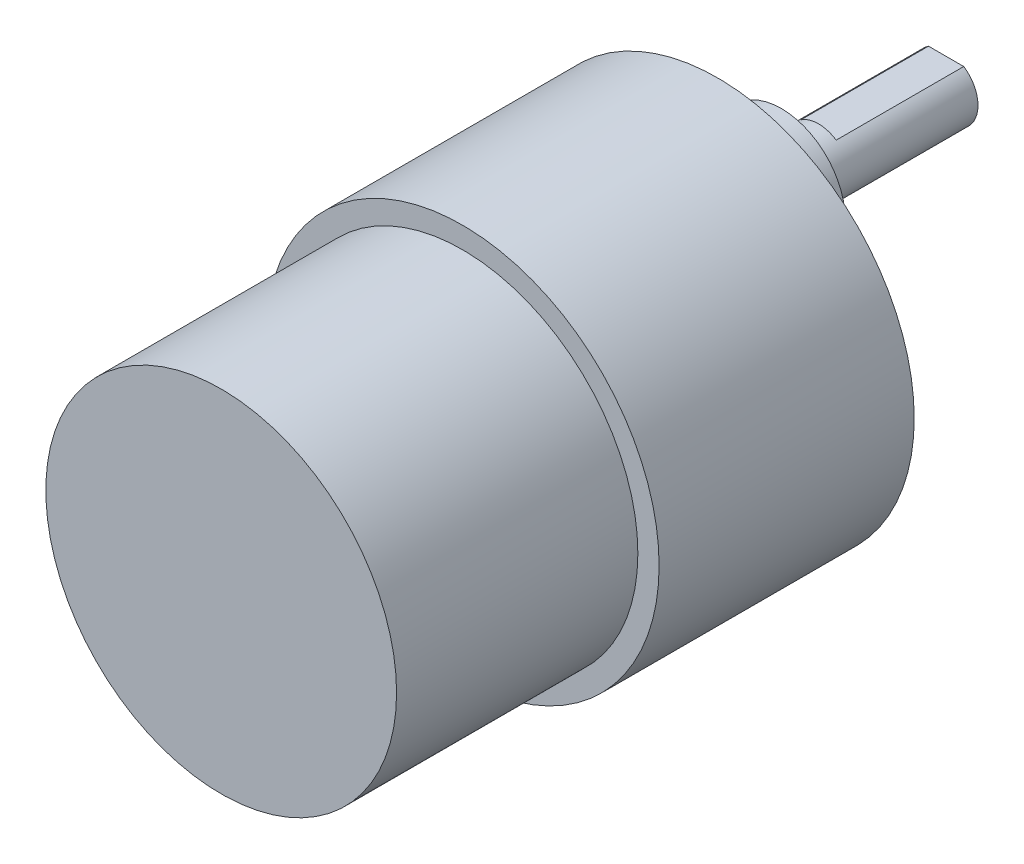
ISO-10303-21;
HEADER;
FILE_DESCRIPTION(('STEP AP214'),'2;1');
FILE_NAME('part.step','',(''),(''),'','','');
FILE_SCHEMA(('AUTOMOTIVE_DESIGN { 1 0 10303 214 1 1 1 1 }'));
ENDSEC;
DATA;
#1=APPLICATION_CONTEXT('core data for automotive mechanical design processes');
#2=APPLICATION_PROTOCOL_DEFINITION('international standard','automotive_design',2000,#1);
#3=PRODUCT_CONTEXT('',#1,'mechanical');
#4=PRODUCT('Part','Part','',(#3));
#5=PRODUCT_RELATED_PRODUCT_CATEGORY('part','',(#4));
#6=PRODUCT_DEFINITION_FORMATION('','',#4);
#7=PRODUCT_DEFINITION_CONTEXT('part definition',#1,'design');
#8=PRODUCT_DEFINITION('design','',#6,#7);
#9=PRODUCT_DEFINITION_SHAPE('','',#8);
#10=(LENGTH_UNIT() NAMED_UNIT(*) SI_UNIT(.MILLI.,.METRE.));
#11=(NAMED_UNIT(*) PLANE_ANGLE_UNIT() SI_UNIT($,.RADIAN.));
#12=(NAMED_UNIT(*) SI_UNIT($,.STERADIAN.) SOLID_ANGLE_UNIT());
#13=UNCERTAINTY_MEASURE_WITH_UNIT(LENGTH_MEASURE(1.E-05),#10,'distance_accuracy_value','');
#14=(GEOMETRIC_REPRESENTATION_CONTEXT(3) GLOBAL_UNCERTAINTY_ASSIGNED_CONTEXT((#13)) GLOBAL_UNIT_ASSIGNED_CONTEXT((#10,
#11,#12)) REPRESENTATION_CONTEXT('',''));
#15=CARTESIAN_POINT('',(0.,0.,0.));
#16=DIRECTION('',(0.,0.,1.));
#17=DIRECTION('',(1.,0.,0.));
#18=AXIS2_PLACEMENT_3D('',#15,#16,#17);
#19=CARTESIAN_POINT('',(0.,0.,24.));
#20=DIRECTION('',(0.,0.,-1.));
#21=DIRECTION('',(-1.,0.,0.));
#22=AXIS2_PLACEMENT_3D('',#19,#20,#21);
#23=CYLINDRICAL_SURFACE('',#22,18.5);
#24=CARTESIAN_POINT('',(0.,0.,24.));
#25=DIRECTION('',(0.,0.,1.));
#26=DIRECTION('',(1.,0.,0.));
#27=AXIS2_PLACEMENT_3D('',#24,#25,#26);
#28=CIRCLE('',#27,18.5);
#29=CARTESIAN_POINT('',(18.5,0.,24.));
#30=VERTEX_POINT('',#29);
#31=EDGE_CURVE('E147',#30,#30,#28,.T.);
#32=ORIENTED_EDGE('',*,*,#31,.F.);
#33=EDGE_LOOP('',(#32));
#34=FACE_BOUND('',#33,.T.);
#35=CARTESIAN_POINT('',(0.,0.,0.));
#36=DIRECTION('',(0.,0.,1.));
#37=DIRECTION('',(1.,0.,0.));
#38=AXIS2_PLACEMENT_3D('',#35,#36,#37);
#39=CIRCLE('',#38,18.5);
#40=CARTESIAN_POINT('',(18.5,0.,0.));
#41=VERTEX_POINT('',#40);
#42=EDGE_CURVE('E144',#41,#41,#39,.T.);
#43=ORIENTED_EDGE('',*,*,#42,.T.);
#44=EDGE_LOOP('',(#43));
#45=FACE_BOUND('',#44,.T.);
#46=ADVANCED_FACE('F39',(#34,#45),#23,.T.);
#47=CARTESIAN_POINT('',(0.,0.,24.));
#48=DIRECTION('',(0.,0.,1.));
#49=DIRECTION('',(1.,0.,0.));
#50=AXIS2_PLACEMENT_3D('',#47,#48,#49);
#51=PLANE('',#50);
#52=CARTESIAN_POINT('',(0.,0.,24.));
#53=DIRECTION('',(0.,0.,1.));
#54=DIRECTION('',(1.,0.,0.));
#55=AXIS2_PLACEMENT_3D('',#52,#53,#54);
#56=CIRCLE('',#55,16.5);
#57=CARTESIAN_POINT('',(16.5,0.,24.));
#58=VERTEX_POINT('',#57);
#59=EDGE_CURVE('E140',#58,#58,#56,.T.);
#60=ORIENTED_EDGE('',*,*,#59,.F.);
#61=EDGE_LOOP('',(#60));
#62=FACE_BOUND('',#61,.T.);
#63=ORIENTED_EDGE('',*,*,#31,.T.);
#64=EDGE_LOOP('',(#63));
#65=FACE_BOUND('',#64,.T.);
#66=ADVANCED_FACE('F175',(#62,#65),#51,.T.);
#67=CARTESIAN_POINT('',(0.,0.,0.));
#68=DIRECTION('',(0.,0.,1.));
#69=DIRECTION('',(1.,0.,0.));
#70=AXIS2_PLACEMENT_3D('',#67,#68,#69);
#71=PLANE('',#70);
#72=CARTESIAN_POINT('',(15.5,0.,0.));
#73=DIRECTION('',(0.,0.,-1.));
#74=DIRECTION('',(-1.,0.,0.));
#75=AXIS2_PLACEMENT_3D('',#72,#73,#74);
#76=CIRCLE('',#75,1.25);
#77=CARTESIAN_POINT('',(14.25,0.,0.));
#78=VERTEX_POINT('',#77);
#79=EDGE_CURVE('E93',#78,#78,#76,.T.);
#80=ORIENTED_EDGE('',*,*,#79,.F.);
#81=EDGE_LOOP('',(#80));
#82=FACE_BOUND('',#81,.T.);
#83=CARTESIAN_POINT('',(7.74999999999997,13.4233937586588,0.));
#84=DIRECTION('',(0.,0.,-1.));
#85=DIRECTION('',(-1.,0.,0.));
#86=AXIS2_PLACEMENT_3D('',#83,#84,#85);
#87=CIRCLE('',#86,1.25);
#88=CARTESIAN_POINT('',(6.49999999999997,13.4233937586588,0.));
#89=VERTEX_POINT('',#88);
#90=EDGE_CURVE('E92',#89,#89,#87,.T.);
#91=ORIENTED_EDGE('',*,*,#90,.F.);
#92=EDGE_LOOP('',(#91));
#93=FACE_BOUND('',#92,.T.);
#94=CARTESIAN_POINT('',(-7.75000000000006,13.4233937586588,0.));
#95=DIRECTION('',(0.,0.,-1.));
#96=DIRECTION('',(-1.,0.,0.));
#97=AXIS2_PLACEMENT_3D('',#94,#95,#96);
#98=CIRCLE('',#97,1.25);
#99=CARTESIAN_POINT('',(-9.00000000000006,13.4233937586588,0.));
#100=VERTEX_POINT('',#99);
#101=EDGE_CURVE('E103',#100,#100,#98,.T.);
#102=ORIENTED_EDGE('',*,*,#101,.F.);
#103=EDGE_LOOP('',(#102));
#104=FACE_BOUND('',#103,.T.);
#105=CARTESIAN_POINT('',(-15.5,-1.04766474552184E-13,0.));
#106=DIRECTION('',(0.,0.,-1.));
#107=DIRECTION('',(-1.,0.,0.));
#108=AXIS2_PLACEMENT_3D('',#105,#106,#107);
#109=CIRCLE('',#108,1.25);
#110=CARTESIAN_POINT('',(-16.75,-1.04766474552184E-13,0.));
#111=VERTEX_POINT('',#110);
#112=EDGE_CURVE('E109',#111,#111,#109,.T.);
#113=ORIENTED_EDGE('',*,*,#112,.F.);
#114=EDGE_LOOP('',(#113));
#115=FACE_BOUND('',#114,.T.);
#116=CARTESIAN_POINT('',(-7.74999999999988,-13.4233937586589,0.));
#117=DIRECTION('',(0.,0.,-1.));
#118=DIRECTION('',(-1.,0.,0.));
#119=AXIS2_PLACEMENT_3D('',#116,#117,#118);
#120=CIRCLE('',#119,1.25);
#121=CARTESIAN_POINT('',(-8.99999999999987,-13.4233937586589,0.));
#122=VERTEX_POINT('',#121);
#123=EDGE_CURVE('E115',#122,#122,#120,.T.);
#124=ORIENTED_EDGE('',*,*,#123,.F.);
#125=EDGE_LOOP('',(#124));
#126=FACE_BOUND('',#125,.T.);
#127=CARTESIAN_POINT('',(7.75000000000016,-13.4233937586587,0.));
#128=DIRECTION('',(0.,0.,-1.));
#129=DIRECTION('',(-1.,0.,0.));
#130=AXIS2_PLACEMENT_3D('',#127,#128,#129);
#131=CIRCLE('',#130,1.25);
#132=CARTESIAN_POINT('',(6.50000000000016,-13.4233937586587,0.));
#133=VERTEX_POINT('',#132);
#134=EDGE_CURVE('E121',#133,#133,#131,.T.);
#135=ORIENTED_EDGE('',*,*,#134,.F.);
#136=EDGE_LOOP('',(#135));
#137=FACE_BOUND('',#136,.T.);
#138=CARTESIAN_POINT('',(0.,7.,0.));
#139=DIRECTION('',(0.,0.,1.));
#140=DIRECTION('',(1.,0.,0.));
#141=AXIS2_PLACEMENT_3D('',#138,#139,#140);
#142=CIRCLE('',#141,6.);
#143=CARTESIAN_POINT('',(6.,7.,0.));
#144=VERTEX_POINT('',#143);
#145=EDGE_CURVE('E150',#144,#144,#142,.F.);
#146=ORIENTED_EDGE('',*,*,#145,.F.);
#147=EDGE_LOOP('',(#146));
#148=FACE_BOUND('',#147,.T.);
#149=ORIENTED_EDGE('',*,*,#42,.F.);
#150=EDGE_LOOP('',(#149));
#151=FACE_BOUND('',#150,.T.);
#152=ADVANCED_FACE('F181',(#82,#93,#104,#115,#126,#137,#148,#151),#71,.F.);
#153=CARTESIAN_POINT('',(0.,0.,46.7));
#154=DIRECTION('',(0.,0.,-1.));
#155=DIRECTION('',(-1.,0.,0.));
#156=AXIS2_PLACEMENT_3D('',#153,#154,#155);
#157=CYLINDRICAL_SURFACE('',#156,16.5);
#158=CARTESIAN_POINT('',(0.,0.,46.7));
#159=DIRECTION('',(0.,0.,1.));
#160=DIRECTION('',(1.,0.,0.));
#161=AXIS2_PLACEMENT_3D('',#158,#159,#160);
#162=CIRCLE('',#161,16.5);
#163=CARTESIAN_POINT('',(16.5,0.,46.7));
#164=VERTEX_POINT('',#163);
#165=EDGE_CURVE('E141',#164,#164,#162,.T.);
#166=ORIENTED_EDGE('',*,*,#165,.F.);
#167=EDGE_LOOP('',(#166));
#168=FACE_BOUND('',#167,.T.);
#169=ORIENTED_EDGE('',*,*,#59,.T.);
#170=EDGE_LOOP('',(#169));
#171=FACE_BOUND('',#170,.T.);
#172=ADVANCED_FACE('F189',(#168,#171),#157,.T.);
#173=CARTESIAN_POINT('',(0.,0.,46.7));
#174=DIRECTION('',(0.,0.,1.));
#175=DIRECTION('',(1.,0.,0.));
#176=AXIS2_PLACEMENT_3D('',#173,#174,#175);
#177=PLANE('',#176);
#178=ORIENTED_EDGE('',*,*,#165,.T.);
#179=EDGE_LOOP('',(#178));
#180=FACE_BOUND('',#179,.T.);
#181=ADVANCED_FACE('F196',(#180),#177,.T.);
#182=CARTESIAN_POINT('',(0.,7.,-6.));
#183=DIRECTION('',(0.,0.,1.));
#184=DIRECTION('',(1.,0.,0.));
#185=AXIS2_PLACEMENT_3D('',#182,#183,#184);
#186=CYLINDRICAL_SURFACE('',#185,6.);
#187=CARTESIAN_POINT('',(0.,7.,-6.));
#188=DIRECTION('',(0.,0.,-1.));
#189=DIRECTION('',(-1.,0.,0.));
#190=AXIS2_PLACEMENT_3D('',#187,#188,#189);
#191=CIRCLE('',#190,6.);
#192=CARTESIAN_POINT('',(-6.,7.,-6.));
#193=VERTEX_POINT('',#192);
#194=EDGE_CURVE('E135',#193,#193,#191,.T.);
#195=ORIENTED_EDGE('',*,*,#194,.F.);
#196=EDGE_LOOP('',(#195));
#197=FACE_BOUND('',#196,.T.);
#198=ORIENTED_EDGE('',*,*,#145,.T.);
#199=EDGE_LOOP('',(#198));
#200=FACE_BOUND('',#199,.T.);
#201=ADVANCED_FACE('F204',(#197,#200),#186,.T.);
#202=CARTESIAN_POINT('',(0.,7.,-6.));
#203=DIRECTION('',(0.,0.,-1.));
#204=DIRECTION('',(-1.,0.,0.));
#205=AXIS2_PLACEMENT_3D('',#202,#203,#204);
#206=PLANE('',#205);
#207=CARTESIAN_POINT('',(0.,7.,-6.));
#208=DIRECTION('',(0.,0.,-1.));
#209=DIRECTION('',(-1.,0.,0.));
#210=AXIS2_PLACEMENT_3D('',#207,#208,#209);
#211=CIRCLE('',#210,3.);
#212=CARTESIAN_POINT('',(-3.,7.,-6.));
#213=VERTEX_POINT('',#212);
#214=EDGE_CURVE('E131',#213,#213,#211,.T.);
#215=ORIENTED_EDGE('',*,*,#214,.F.);
#216=EDGE_LOOP('',(#215));
#217=FACE_BOUND('',#216,.T.);
#218=ORIENTED_EDGE('',*,*,#194,.T.);
#219=EDGE_LOOP('',(#218));
#220=FACE_BOUND('',#219,.T.);
#221=ADVANCED_FACE('F171',(#217,#220),#206,.T.);
#222=CARTESIAN_POINT('',(0.,7.,-21.5));
#223=DIRECTION('',(0.,0.,1.));
#224=DIRECTION('',(1.,0.,0.));
#225=AXIS2_PLACEMENT_3D('',#222,#223,#224);
#226=CYLINDRICAL_SURFACE('',#225,3.);
#227=CARTESIAN_POINT('',(0.,7.,-21.5));
#228=DIRECTION('',(0.,0.,-1.));
#229=DIRECTION('',(-1.,0.,0.));
#230=AXIS2_PLACEMENT_3D('',#227,#228,#229);
#231=CIRCLE('',#230,3.);
#232=CARTESIAN_POINT('',(1.6583123951777,9.5,-21.5));
#233=VERTEX_POINT('',#232);
#234=CARTESIAN_POINT('',(-1.6583123951777,9.5,-21.5));
#235=VERTEX_POINT('',#234);
#236=EDGE_CURVE('E132',#233,#235,#231,.T.);
#237=ORIENTED_EDGE('',*,*,#236,.F.);
#238=DIRECTION('',(0.,0.,1.));
#239=VECTOR('',#238,1.);
#240=CARTESIAN_POINT('',(1.6583123951777,9.5,-21.5));
#241=LINE('',#240,#239);
#242=CARTESIAN_POINT('',(1.6583123951777,9.5,-9.5));
#243=VERTEX_POINT('',#242);
#244=EDGE_CURVE('E53',#233,#243,#241,.T.);
#245=ORIENTED_EDGE('',*,*,#244,.T.);
#246=CARTESIAN_POINT('',(0.,7.,-9.5));
#247=DIRECTION('',(0.,0.,-1.));
#248=DIRECTION('',(-1.,0.,0.));
#249=AXIS2_PLACEMENT_3D('',#246,#247,#248);
#250=CIRCLE('',#249,3.);
#251=CARTESIAN_POINT('',(-1.6583123951777,9.5,-9.5));
#252=VERTEX_POINT('',#251);
#253=EDGE_CURVE('E11',#252,#243,#250,.T.);
#254=ORIENTED_EDGE('',*,*,#253,.F.);
#255=DIRECTION('',(0.,0.,1.));
#256=VECTOR('',#255,1.);
#257=CARTESIAN_POINT('',(-1.6583123951777,9.5,-21.5));
#258=LINE('',#257,#256);
#259=EDGE_CURVE('E58',#252,#235,#258,.F.);
#260=ORIENTED_EDGE('',*,*,#259,.T.);
#261=EDGE_LOOP('',(#237,#245,#254,#260));
#262=FACE_BOUND('',#261,.T.);
#263=ORIENTED_EDGE('',*,*,#214,.T.);
#264=EDGE_LOOP('',(#263));
#265=FACE_BOUND('',#264,.T.);
#266=ADVANCED_FACE('F159',(#262,#265),#226,.T.);
#267=CARTESIAN_POINT('',(0.,7.,-21.5));
#268=DIRECTION('',(0.,0.,-1.));
#269=DIRECTION('',(-1.,0.,0.));
#270=AXIS2_PLACEMENT_3D('',#267,#268,#269);
#271=PLANE('',#270);
#272=DIRECTION('',(-1.,0.,0.));
#273=VECTOR('',#272,1.);
#274=CARTESIAN_POINT('',(0.,9.5,-21.5));
#275=LINE('',#274,#273);
#276=EDGE_CURVE('E46',#233,#235,#275,.T.);
#277=ORIENTED_EDGE('',*,*,#276,.F.);
#278=ORIENTED_EDGE('',*,*,#236,.T.);
#279=EDGE_LOOP('',(#277,#278));
#280=FACE_BOUND('',#279,.T.);
#281=ADVANCED_FACE('F161',(#280),#271,.T.);
#282=CARTESIAN_POINT('',(0.,0.,-9.5));
#283=DIRECTION('',(0.,0.,-1.));
#284=DIRECTION('',(-1.,0.,0.));
#285=AXIS2_PLACEMENT_3D('',#282,#283,#284);
#286=PLANE('',#285);
#287=ORIENTED_EDGE('',*,*,#253,.T.);
#288=DIRECTION('',(-1.,0.,0.));
#289=VECTOR('',#288,1.);
#290=CARTESIAN_POINT('',(2.7491312128258,9.5,-9.5));
#291=LINE('',#290,#289);
#292=EDGE_CURVE('E127',#243,#252,#291,.T.);
#293=ORIENTED_EDGE('',*,*,#292,.T.);
#294=EDGE_LOOP('',(#287,#293));
#295=FACE_BOUND('',#294,.T.);
#296=ADVANCED_FACE('F163',(#295),#286,.T.);
#297=CARTESIAN_POINT('',(2.7491312128258,9.5,-9.5));
#298=DIRECTION('',(0.,-1.,0.));
#299=DIRECTION('',(0.,0.,-1.));
#300=AXIS2_PLACEMENT_3D('',#297,#298,#299);
#301=PLANE('',#300);
#302=ORIENTED_EDGE('',*,*,#276,.T.);
#303=ORIENTED_EDGE('',*,*,#259,.F.);
#304=ORIENTED_EDGE('',*,*,#292,.F.);
#305=ORIENTED_EDGE('',*,*,#244,.F.);
#306=EDGE_LOOP('',(#302,#303,#304,#305));
#307=FACE_BOUND('',#306,.T.);
#308=ADVANCED_FACE('F154',(#307),#301,.F.);
#309=CARTESIAN_POINT('',(7.75000000000016,-13.4233937586587,7.5));
#310=DIRECTION('',(0.,0.,-1.));
#311=DIRECTION('',(-1.,0.,0.));
#312=AXIS2_PLACEMENT_3D('',#309,#310,#311);
#313=CONICAL_SURFACE('',#312,1.25,1.02974425867665);
#314=CARTESIAN_POINT('',(7.75000000000015,-13.4233937586587,8.25107577378445));
#315=VERTEX_POINT('',#314);
#316=VERTEX_LOOP('',#315);
#317=FACE_BOUND('',#316,.T.);
#318=CARTESIAN_POINT('',(7.75000000000016,-13.4233937586587,7.5));
#319=DIRECTION('',(0.,0.,-1.));
#320=DIRECTION('',(-1.,0.,0.));
#321=AXIS2_PLACEMENT_3D('',#318,#319,#320);
#322=CIRCLE('',#321,1.25);
#323=CARTESIAN_POINT('',(6.50000000000016,-13.4233937586587,7.5));
#324=VERTEX_POINT('',#323);
#325=EDGE_CURVE('E124',#324,#324,#322,.T.);
#326=ORIENTED_EDGE('',*,*,#325,.T.);
#327=EDGE_LOOP('',(#326));
#328=FACE_BOUND('',#327,.T.);
#329=ADVANCED_FACE('F242',(#317,#328),#313,.F.);
#330=CARTESIAN_POINT('',(7.75000000000016,-13.4233937586587,0.));
#331=DIRECTION('',(0.,0.,-1.));
#332=DIRECTION('',(-1.,0.,0.));
#333=AXIS2_PLACEMENT_3D('',#330,#331,#332);
#334=CYLINDRICAL_SURFACE('',#333,1.25);
#335=ORIENTED_EDGE('',*,*,#325,.F.);
#336=EDGE_LOOP('',(#335));
#337=FACE_BOUND('',#336,.T.);
#338=ORIENTED_EDGE('',*,*,#134,.T.);
#339=EDGE_LOOP('',(#338));
#340=FACE_BOUND('',#339,.T.);
#341=ADVANCED_FACE('F250',(#337,#340),#334,.F.);
#342=CARTESIAN_POINT('',(-7.74999999999988,-13.4233937586589,7.5));
#343=DIRECTION('',(0.,0.,-1.));
#344=DIRECTION('',(-1.,0.,0.));
#345=AXIS2_PLACEMENT_3D('',#342,#343,#344);
#346=CONICAL_SURFACE('',#345,1.25,1.02974425867665);
#347=CARTESIAN_POINT('',(-7.74999999999988,-13.4233937586589,8.25107577378445));
#348=VERTEX_POINT('',#347);
#349=VERTEX_LOOP('',#348);
#350=FACE_BOUND('',#349,.T.);
#351=CARTESIAN_POINT('',(-7.74999999999988,-13.4233937586589,7.5));
#352=DIRECTION('',(0.,0.,-1.));
#353=DIRECTION('',(-1.,0.,0.));
#354=AXIS2_PLACEMENT_3D('',#351,#352,#353);
#355=CIRCLE('',#354,1.25);
#356=CARTESIAN_POINT('',(-8.99999999999987,-13.4233937586589,7.5));
#357=VERTEX_POINT('',#356);
#358=EDGE_CURVE('E118',#357,#357,#355,.T.);
#359=ORIENTED_EDGE('',*,*,#358,.T.);
#360=EDGE_LOOP('',(#359));
#361=FACE_BOUND('',#360,.T.);
#362=ADVANCED_FACE('F258',(#350,#361),#346,.F.);
#363=CARTESIAN_POINT('',(-7.74999999999988,-13.4233937586589,0.));
#364=DIRECTION('',(0.,0.,-1.));
#365=DIRECTION('',(-1.,0.,0.));
#366=AXIS2_PLACEMENT_3D('',#363,#364,#365);
#367=CYLINDRICAL_SURFACE('',#366,1.25);
#368=ORIENTED_EDGE('',*,*,#358,.F.);
#369=EDGE_LOOP('',(#368));
#370=FACE_BOUND('',#369,.T.);
#371=ORIENTED_EDGE('',*,*,#123,.T.);
#372=EDGE_LOOP('',(#371));
#373=FACE_BOUND('',#372,.T.);
#374=ADVANCED_FACE('F267',(#370,#373),#367,.F.);
#375=CARTESIAN_POINT('',(-15.5,-1.04766474552184E-13,7.5));
#376=DIRECTION('',(0.,0.,-1.));
#377=DIRECTION('',(-1.,0.,0.));
#378=AXIS2_PLACEMENT_3D('',#375,#376,#377);
#379=CONICAL_SURFACE('',#378,1.25,1.02974425867665);
#380=CARTESIAN_POINT('',(-15.5,-1.04766474552184E-13,8.25107577378445));
#381=VERTEX_POINT('',#380);
#382=VERTEX_LOOP('',#381);
#383=FACE_BOUND('',#382,.T.);
#384=CARTESIAN_POINT('',(-15.5,-1.04766474552184E-13,7.5));
#385=DIRECTION('',(0.,0.,-1.));
#386=DIRECTION('',(-1.,0.,0.));
#387=AXIS2_PLACEMENT_3D('',#384,#385,#386);
#388=CIRCLE('',#387,1.25);
#389=CARTESIAN_POINT('',(-16.75,-1.04766474552184E-13,7.5));
#390=VERTEX_POINT('',#389);
#391=EDGE_CURVE('E112',#390,#390,#388,.T.);
#392=ORIENTED_EDGE('',*,*,#391,.T.);
#393=EDGE_LOOP('',(#392));
#394=FACE_BOUND('',#393,.T.);
#395=ADVANCED_FACE('F275',(#383,#394),#379,.F.);
#396=CARTESIAN_POINT('',(-15.5,-1.04766474552184E-13,0.));
#397=DIRECTION('',(0.,0.,-1.));
#398=DIRECTION('',(-1.,0.,0.));
#399=AXIS2_PLACEMENT_3D('',#396,#397,#398);
#400=CYLINDRICAL_SURFACE('',#399,1.25);
#401=ORIENTED_EDGE('',*,*,#391,.F.);
#402=EDGE_LOOP('',(#401));
#403=FACE_BOUND('',#402,.T.);
#404=ORIENTED_EDGE('',*,*,#112,.T.);
#405=EDGE_LOOP('',(#404));
#406=FACE_BOUND('',#405,.T.);
#407=ADVANCED_FACE('F284',(#403,#406),#400,.F.);
#408=CARTESIAN_POINT('',(-7.75000000000006,13.4233937586588,7.5));
#409=DIRECTION('',(0.,0.,-1.));
#410=DIRECTION('',(-1.,0.,0.));
#411=AXIS2_PLACEMENT_3D('',#408,#409,#410);
#412=CONICAL_SURFACE('',#411,1.25,1.02974425867665);
#413=CARTESIAN_POINT('',(-7.75000000000006,13.4233937586588,8.25107577378445));
#414=VERTEX_POINT('',#413);
#415=VERTEX_LOOP('',#414);
#416=FACE_BOUND('',#415,.T.);
#417=CARTESIAN_POINT('',(-7.75000000000006,13.4233937586588,7.5));
#418=DIRECTION('',(0.,0.,-1.));
#419=DIRECTION('',(-1.,0.,0.));
#420=AXIS2_PLACEMENT_3D('',#417,#418,#419);
#421=CIRCLE('',#420,1.25);
#422=CARTESIAN_POINT('',(-9.00000000000006,13.4233937586588,7.5));
#423=VERTEX_POINT('',#422);
#424=EDGE_CURVE('E106',#423,#423,#421,.T.);
#425=ORIENTED_EDGE('',*,*,#424,.T.);
#426=EDGE_LOOP('',(#425));
#427=FACE_BOUND('',#426,.T.);
#428=ADVANCED_FACE('F292',(#416,#427),#412,.F.);
#429=CARTESIAN_POINT('',(-7.75000000000006,13.4233937586588,0.));
#430=DIRECTION('',(0.,0.,-1.));
#431=DIRECTION('',(-1.,0.,0.));
#432=AXIS2_PLACEMENT_3D('',#429,#430,#431);
#433=CYLINDRICAL_SURFACE('',#432,1.25);
#434=ORIENTED_EDGE('',*,*,#424,.F.);
#435=EDGE_LOOP('',(#434));
#436=FACE_BOUND('',#435,.T.);
#437=ORIENTED_EDGE('',*,*,#101,.T.);
#438=EDGE_LOOP('',(#437));
#439=FACE_BOUND('',#438,.T.);
#440=ADVANCED_FACE('F301',(#436,#439),#433,.F.);
#441=CARTESIAN_POINT('',(7.74999999999997,13.4233937586588,7.5));
#442=DIRECTION('',(0.,0.,-1.));
#443=DIRECTION('',(-1.,0.,0.));
#444=AXIS2_PLACEMENT_3D('',#441,#442,#443);
#445=CONICAL_SURFACE('',#444,1.25,1.02974425867665);
#446=CARTESIAN_POINT('',(7.74999999999997,13.4233937586588,8.25107577378445));
#447=VERTEX_POINT('',#446);
#448=VERTEX_LOOP('',#447);
#449=FACE_BOUND('',#448,.T.);
#450=CARTESIAN_POINT('',(7.74999999999997,13.4233937586588,7.5));
#451=DIRECTION('',(0.,0.,-1.));
#452=DIRECTION('',(-1.,0.,0.));
#453=AXIS2_PLACEMENT_3D('',#450,#451,#452);
#454=CIRCLE('',#453,1.25);
#455=CARTESIAN_POINT('',(6.49999999999997,13.4233937586588,7.5));
#456=VERTEX_POINT('',#455);
#457=EDGE_CURVE('E96',#456,#456,#454,.T.);
#458=ORIENTED_EDGE('',*,*,#457,.T.);
#459=EDGE_LOOP('',(#458));
#460=FACE_BOUND('',#459,.T.);
#461=ADVANCED_FACE('F309',(#449,#460),#445,.F.);
#462=CARTESIAN_POINT('',(7.74999999999997,13.4233937586588,0.));
#463=DIRECTION('',(0.,0.,-1.));
#464=DIRECTION('',(-1.,0.,0.));
#465=AXIS2_PLACEMENT_3D('',#462,#463,#464);
#466=CYLINDRICAL_SURFACE('',#465,1.25);
#467=ORIENTED_EDGE('',*,*,#457,.F.);
#468=EDGE_LOOP('',(#467));
#469=FACE_BOUND('',#468,.T.);
#470=ORIENTED_EDGE('',*,*,#90,.T.);
#471=EDGE_LOOP('',(#470));
#472=FACE_BOUND('',#471,.T.);
#473=ADVANCED_FACE('F86',(#469,#472),#466,.F.);
#474=CARTESIAN_POINT('',(15.5,0.,7.5));
#475=DIRECTION('',(0.,0.,-1.));
#476=DIRECTION('',(-1.,0.,0.));
#477=AXIS2_PLACEMENT_3D('',#474,#475,#476);
#478=CONICAL_SURFACE('',#477,1.25,1.02974425867665);
#479=CARTESIAN_POINT('',(15.5,0.,8.25107577378445));
#480=VERTEX_POINT('',#479);
#481=VERTEX_LOOP('',#480);
#482=FACE_BOUND('',#481,.T.);
#483=CARTESIAN_POINT('',(15.5,0.,7.5));
#484=DIRECTION('',(0.,0.,-1.));
#485=DIRECTION('',(-1.,0.,0.));
#486=AXIS2_PLACEMENT_3D('',#483,#484,#485);
#487=CIRCLE('',#486,1.25);
#488=CARTESIAN_POINT('',(14.25,0.,7.5));
#489=VERTEX_POINT('',#488);
#490=EDGE_CURVE('E90',#489,#489,#487,.T.);
#491=ORIENTED_EDGE('',*,*,#490,.T.);
#492=EDGE_LOOP('',(#491));
#493=FACE_BOUND('',#492,.T.);
#494=ADVANCED_FACE('F82',(#482,#493),#478,.F.);
#495=CARTESIAN_POINT('',(15.5,0.,0.));
#496=DIRECTION('',(0.,0.,-1.));
#497=DIRECTION('',(-1.,0.,0.));
#498=AXIS2_PLACEMENT_3D('',#495,#496,#497);
#499=CYLINDRICAL_SURFACE('',#498,1.25);
#500=ORIENTED_EDGE('',*,*,#490,.F.);
#501=EDGE_LOOP('',(#500));
#502=FACE_BOUND('',#501,.T.);
#503=ORIENTED_EDGE('',*,*,#79,.T.);
#504=EDGE_LOOP('',(#503));
#505=FACE_BOUND('',#504,.T.);
#506=ADVANCED_FACE('F85',(#502,#505),#499,.F.);
#507=CLOSED_SHELL('',(#46,#66,#152,#172,#181,#201,#221,#266,#281,#296,#308,#329,#341,#362,#374,
#395,#407,#428,#440,#461,#473,#494,#506));
#508=MANIFOLD_SOLID_BREP('B2',#507);
#509=ADVANCED_BREP_SHAPE_REPRESENTATION('',(#18,#508),#14);
#510=SHAPE_DEFINITION_REPRESENTATION(#9,#509);
ENDSEC;
END-ISO-10303-21;
